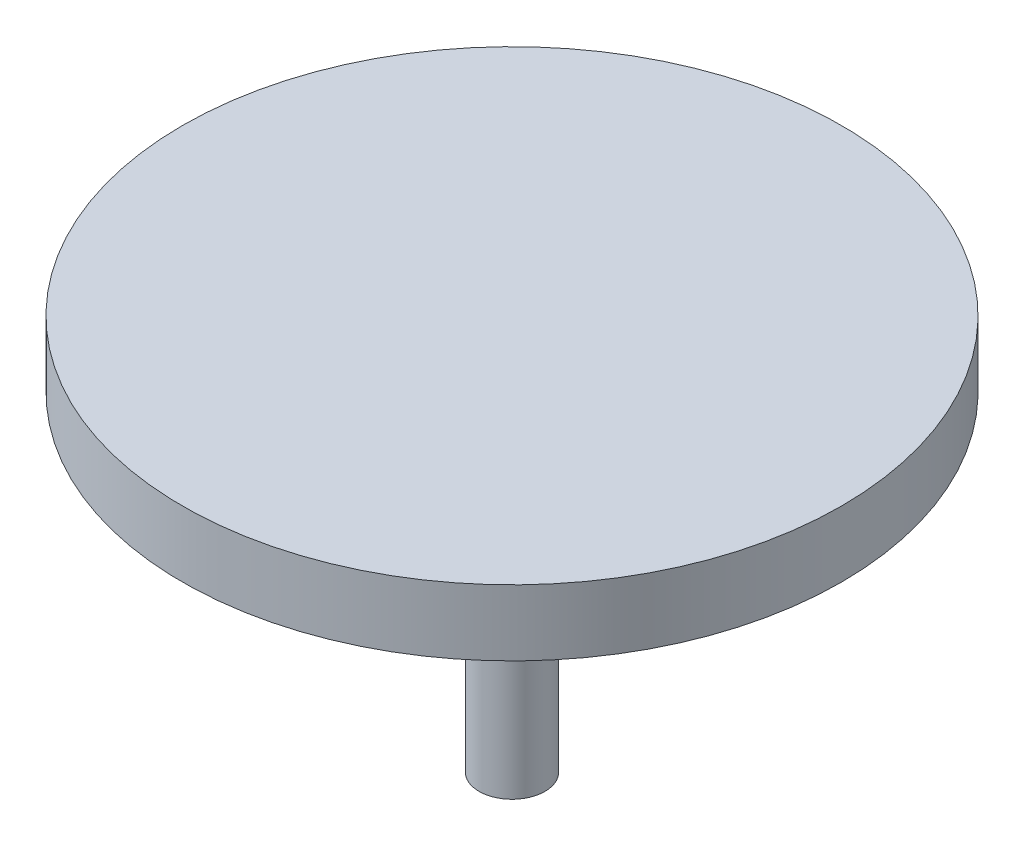
ISO-10303-21;
HEADER;
FILE_DESCRIPTION(('STEP AP214'),'2;1');
FILE_NAME('part.step','',(''),(''),'','','');
FILE_SCHEMA(('AUTOMOTIVE_DESIGN { 1 0 10303 214 1 1 1 1 }'));
ENDSEC;
DATA;
#1=APPLICATION_CONTEXT('core data for automotive mechanical design processes');
#2=APPLICATION_PROTOCOL_DEFINITION('international standard','automotive_design',2000,#1);
#3=PRODUCT_CONTEXT('',#1,'mechanical');
#4=PRODUCT('Part','Part','',(#3));
#5=PRODUCT_RELATED_PRODUCT_CATEGORY('part','',(#4));
#6=PRODUCT_DEFINITION_FORMATION('','',#4);
#7=PRODUCT_DEFINITION_CONTEXT('part definition',#1,'design');
#8=PRODUCT_DEFINITION('design','',#6,#7);
#9=PRODUCT_DEFINITION_SHAPE('','',#8);
#10=(LENGTH_UNIT() NAMED_UNIT(*) SI_UNIT(.MILLI.,.METRE.));
#11=(NAMED_UNIT(*) PLANE_ANGLE_UNIT() SI_UNIT($,.RADIAN.));
#12=(NAMED_UNIT(*) SI_UNIT($,.STERADIAN.) SOLID_ANGLE_UNIT());
#13=UNCERTAINTY_MEASURE_WITH_UNIT(LENGTH_MEASURE(1.E-05),#10,'distance_accuracy_value','');
#14=(GEOMETRIC_REPRESENTATION_CONTEXT(3) GLOBAL_UNCERTAINTY_ASSIGNED_CONTEXT((#13)) GLOBAL_UNIT_ASSIGNED_CONTEXT((#10,
#11,#12)) REPRESENTATION_CONTEXT('',''));
#15=CARTESIAN_POINT('',(0.,0.,0.));
#16=DIRECTION('',(0.,0.,1.));
#17=DIRECTION('',(1.,0.,0.));
#18=AXIS2_PLACEMENT_3D('',#15,#16,#17);
#19=CARTESIAN_POINT('',(0.,-10.,0.));
#20=DIRECTION('',(0.,1.,0.));
#21=DIRECTION('',(-1.,0.,0.));
#22=AXIS2_PLACEMENT_3D('',#19,#20,#21);
#23=CYLINDRICAL_SURFACE('',#22,1.);
#24=CARTESIAN_POINT('',(0.,-10.,0.));
#25=DIRECTION('',(0.,-1.,0.));
#26=DIRECTION('',(1.,0.,0.));
#27=AXIS2_PLACEMENT_3D('',#24,#25,#26);
#28=CIRCLE('',#27,1.);
#29=CARTESIAN_POINT('',(1.,-10.,0.));
#30=VERTEX_POINT('',#29);
#31=EDGE_CURVE('E10',#30,#30,#28,.T.);
#32=ORIENTED_EDGE('',*,*,#31,.F.);
#33=EDGE_LOOP('',(#32));
#34=FACE_BOUND('',#33,.T.);
#35=CARTESIAN_POINT('',(0.,0.,0.));
#36=DIRECTION('',(0.,-1.,0.));
#37=DIRECTION('',(1.,0.,0.));
#38=AXIS2_PLACEMENT_3D('',#35,#36,#37);
#39=CIRCLE('',#38,1.);
#40=CARTESIAN_POINT('',(1.,0.,0.));
#41=VERTEX_POINT('',#40);
#42=EDGE_CURVE('E22',#41,#41,#39,.T.);
#43=ORIENTED_EDGE('',*,*,#42,.T.);
#44=EDGE_LOOP('',(#43));
#45=FACE_BOUND('',#44,.T.);
#46=ADVANCED_FACE('F15',(#34,#45),#23,.T.);
#47=CARTESIAN_POINT('',(0.,-10.,0.));
#48=DIRECTION('',(0.,-1.,0.));
#49=DIRECTION('',(1.,0.,0.));
#50=AXIS2_PLACEMENT_3D('',#47,#48,#49);
#51=PLANE('',#50);
#52=ORIENTED_EDGE('',*,*,#31,.T.);
#53=EDGE_LOOP('',(#52));
#54=FACE_BOUND('',#53,.T.);
#55=ADVANCED_FACE('F58',(#54),#51,.T.);
#56=CARTESIAN_POINT('',(0.,2.,0.));
#57=DIRECTION('',(0.,-1.,0.));
#58=DIRECTION('',(1.,0.,0.));
#59=AXIS2_PLACEMENT_3D('',#56,#57,#58);
#60=CYLINDRICAL_SURFACE('',#59,10.);
#61=CARTESIAN_POINT('',(0.,2.,0.));
#62=DIRECTION('',(0.,1.,0.));
#63=DIRECTION('',(-1.,0.,0.));
#64=AXIS2_PLACEMENT_3D('',#61,#62,#63);
#65=CIRCLE('',#64,10.);
#66=CARTESIAN_POINT('',(-10.,2.,0.));
#67=VERTEX_POINT('',#66);
#68=EDGE_CURVE('E29',#67,#67,#65,.T.);
#69=ORIENTED_EDGE('',*,*,#68,.F.);
#70=EDGE_LOOP('',(#69));
#71=FACE_BOUND('',#70,.T.);
#72=CARTESIAN_POINT('',(0.,0.,0.));
#73=DIRECTION('',(0.,1.,0.));
#74=DIRECTION('',(-1.,0.,0.));
#75=AXIS2_PLACEMENT_3D('',#72,#73,#74);
#76=CIRCLE('',#75,10.);
#77=CARTESIAN_POINT('',(-10.,0.,0.));
#78=VERTEX_POINT('',#77);
#79=EDGE_CURVE('E35',#78,#78,#76,.T.);
#80=ORIENTED_EDGE('',*,*,#79,.T.);
#81=EDGE_LOOP('',(#80));
#82=FACE_BOUND('',#81,.T.);
#83=ADVANCED_FACE('F44',(#71,#82),#60,.T.);
#84=CARTESIAN_POINT('',(0.,2.,0.));
#85=DIRECTION('',(0.,1.,0.));
#86=DIRECTION('',(-1.,0.,0.));
#87=AXIS2_PLACEMENT_3D('',#84,#85,#86);
#88=PLANE('',#87);
#89=ORIENTED_EDGE('',*,*,#68,.T.);
#90=EDGE_LOOP('',(#89));
#91=FACE_BOUND('',#90,.T.);
#92=ADVANCED_FACE('F48',(#91),#88,.T.);
#93=CARTESIAN_POINT('',(0.,0.,0.));
#94=DIRECTION('',(0.,1.,0.));
#95=DIRECTION('',(-1.,0.,0.));
#96=AXIS2_PLACEMENT_3D('',#93,#94,#95);
#97=PLANE('',#96);
#98=ORIENTED_EDGE('',*,*,#42,.F.);
#99=EDGE_LOOP('',(#98));
#100=FACE_BOUND('',#99,.T.);
#101=ORIENTED_EDGE('',*,*,#79,.F.);
#102=EDGE_LOOP('',(#101));
#103=FACE_BOUND('',#102,.T.);
#104=ADVANCED_FACE('F46',(#100,#103),#97,.F.);
#105=CLOSED_SHELL('',(#46,#55,#83,#92,#104));
#106=MANIFOLD_SOLID_BREP('B1',#105);
#107=ADVANCED_BREP_SHAPE_REPRESENTATION('',(#18,#106),#14);
#108=SHAPE_DEFINITION_REPRESENTATION(#9,#107);
ENDSEC;
END-ISO-10303-21;
